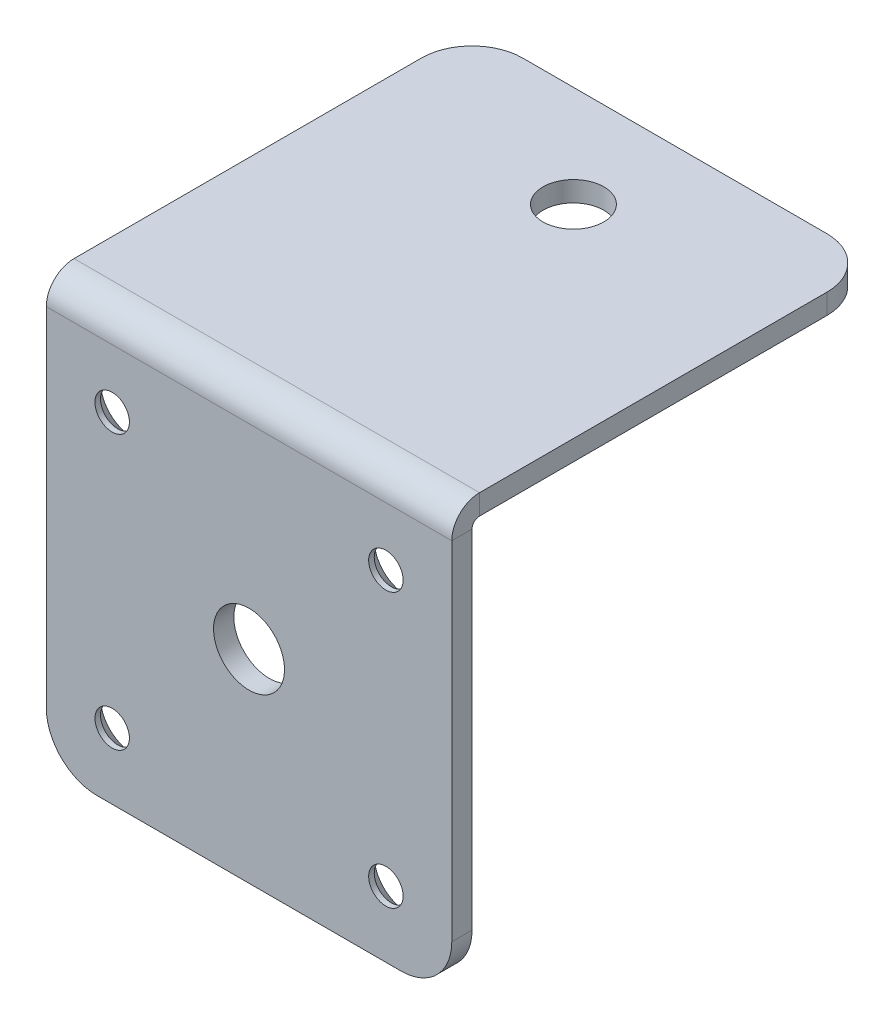
ISO-10303-21;
HEADER;
FILE_DESCRIPTION(('STEP AP214'),'2;1');
FILE_NAME('part.step','',(''),(''),'','','');
FILE_SCHEMA(('AUTOMOTIVE_DESIGN { 1 0 10303 214 1 1 1 1 }'));
ENDSEC;
DATA;
#1=APPLICATION_CONTEXT('core data for automotive mechanical design processes');
#2=APPLICATION_PROTOCOL_DEFINITION('international standard','automotive_design',2000,#1);
#3=PRODUCT_CONTEXT('',#1,'mechanical');
#4=PRODUCT('Part','Part','',(#3));
#5=PRODUCT_RELATED_PRODUCT_CATEGORY('part','',(#4));
#6=PRODUCT_DEFINITION_FORMATION('','',#4);
#7=PRODUCT_DEFINITION_CONTEXT('part definition',#1,'design');
#8=PRODUCT_DEFINITION('design','',#6,#7);
#9=PRODUCT_DEFINITION_SHAPE('','',#8);
#10=(LENGTH_UNIT() NAMED_UNIT(*) SI_UNIT(.MILLI.,.METRE.));
#11=(NAMED_UNIT(*) PLANE_ANGLE_UNIT() SI_UNIT($,.RADIAN.));
#12=(NAMED_UNIT(*) SI_UNIT($,.STERADIAN.) SOLID_ANGLE_UNIT());
#13=UNCERTAINTY_MEASURE_WITH_UNIT(LENGTH_MEASURE(1.E-05),#10,'distance_accuracy_value','');
#14=(GEOMETRIC_REPRESENTATION_CONTEXT(3) GLOBAL_UNCERTAINTY_ASSIGNED_CONTEXT((#13)) GLOBAL_UNIT_ASSIGNED_CONTEXT((#10,
#11,#12)) REPRESENTATION_CONTEXT('',''));
#15=CARTESIAN_POINT('',(0.,0.,0.));
#16=DIRECTION('',(0.,0.,1.));
#17=DIRECTION('',(1.,0.,0.));
#18=AXIS2_PLACEMENT_3D('',#15,#16,#17);
#19=CARTESIAN_POINT('',(0.,-2.,40.));
#20=DIRECTION('',(0.,1.,0.));
#21=DIRECTION('',(0.,0.,1.));
#22=AXIS2_PLACEMENT_3D('',#19,#20,#21);
#23=PLANE('',#22);
#24=CARTESIAN_POINT('',(20.,-2.,10.));
#25=DIRECTION('',(0.,1.,0.));
#26=DIRECTION('',(0.,0.,1.));
#27=AXIS2_PLACEMENT_3D('',#24,#25,#26);
#28=CIRCLE('',#27,3.);
#29=CARTESIAN_POINT('',(20.,-2.,13.));
#30=VERTEX_POINT('',#29);
#31=EDGE_CURVE('E190',#30,#30,#28,.F.);
#32=ORIENTED_EDGE('',*,*,#31,.F.);
#33=EDGE_LOOP('',(#32));
#34=FACE_BOUND('',#33,.T.);
#35=DIRECTION('',(0.,0.,-1.));
#36=VECTOR('',#35,1.);
#37=CARTESIAN_POINT('',(0.,-2.,40.));
#38=LINE('',#37,#36);
#39=CARTESIAN_POINT('',(0.,-2.,39.2634));
#40=VERTEX_POINT('',#39);
#41=CARTESIAN_POINT('',(0.,-2.,5.));
#42=VERTEX_POINT('',#41);
#43=EDGE_CURVE('E198',#40,#42,#38,.T.);
#44=ORIENTED_EDGE('',*,*,#43,.T.);
#45=CARTESIAN_POINT('',(5.,-2.,5.));
#46=DIRECTION('',(0.,1.,0.));
#47=DIRECTION('',(0.,0.,1.));
#48=AXIS2_PLACEMENT_3D('',#45,#46,#47);
#49=CIRCLE('',#48,5.);
#50=CARTESIAN_POINT('',(5.,-2.,0.));
#51=VERTEX_POINT('',#50);
#52=EDGE_CURVE('E42',#42,#51,#49,.F.);
#53=ORIENTED_EDGE('',*,*,#52,.T.);
#54=DIRECTION('',(1.,0.,0.));
#55=VECTOR('',#54,1.);
#56=CARTESIAN_POINT('',(0.,-2.,0.));
#57=LINE('',#56,#55);
#58=CARTESIAN_POINT('',(35.,-2.,0.));
#59=VERTEX_POINT('',#58);
#60=EDGE_CURVE('E193',#51,#59,#57,.T.);
#61=ORIENTED_EDGE('',*,*,#60,.T.);
#62=CARTESIAN_POINT('',(35.,-2.,5.));
#63=DIRECTION('',(0.,1.,0.));
#64=DIRECTION('',(0.,0.,1.));
#65=AXIS2_PLACEMENT_3D('',#62,#63,#64);
#66=CIRCLE('',#65,5.);
#67=CARTESIAN_POINT('',(40.,-2.,5.));
#68=VERTEX_POINT('',#67);
#69=EDGE_CURVE('E49',#59,#68,#66,.F.);
#70=ORIENTED_EDGE('',*,*,#69,.T.);
#71=DIRECTION('',(0.,0.,-1.));
#72=VECTOR('',#71,1.);
#73=CARTESIAN_POINT('',(40.,-2.,40.));
#74=LINE('',#73,#72);
#75=CARTESIAN_POINT('',(40.,-2.,39.2634));
#76=VERTEX_POINT('',#75);
#77=EDGE_CURVE('E205',#76,#68,#74,.T.);
#78=ORIENTED_EDGE('',*,*,#77,.F.);
#79=DIRECTION('',(-1.,0.,0.));
#80=VECTOR('',#79,1.);
#81=CARTESIAN_POINT('',(0.,-2.,39.2634));
#82=LINE('',#81,#80);
#83=EDGE_CURVE('E180',#40,#76,#82,.F.);
#84=ORIENTED_EDGE('',*,*,#83,.F.);
#85=EDGE_LOOP('',(#44,#53,#61,#70,#78,#84));
#86=FACE_BOUND('',#85,.T.);
#87=ADVANCED_FACE('F34',(#34,#86),#23,.F.);
#88=CARTESIAN_POINT('',(0.,0.,40.));
#89=DIRECTION('',(0.,1.,0.));
#90=DIRECTION('',(0.,0.,1.));
#91=AXIS2_PLACEMENT_3D('',#88,#89,#90);
#92=PLANE('',#91);
#93=CARTESIAN_POINT('',(20.,0.,10.));
#94=DIRECTION('',(0.,1.,0.));
#95=DIRECTION('',(0.,0.,1.));
#96=AXIS2_PLACEMENT_3D('',#93,#94,#95);
#97=CIRCLE('',#96,3.);
#98=CARTESIAN_POINT('',(20.,0.,13.));
#99=VERTEX_POINT('',#98);
#100=EDGE_CURVE('E186',#99,#99,#97,.T.);
#101=ORIENTED_EDGE('',*,*,#100,.F.);
#102=EDGE_LOOP('',(#101));
#103=FACE_BOUND('',#102,.T.);
#104=DIRECTION('',(1.,0.,0.));
#105=VECTOR('',#104,1.);
#106=CARTESIAN_POINT('',(0.,0.,0.));
#107=LINE('',#106,#105);
#108=CARTESIAN_POINT('',(5.,0.,0.));
#109=VERTEX_POINT('',#108);
#110=CARTESIAN_POINT('',(35.,0.,0.));
#111=VERTEX_POINT('',#110);
#112=EDGE_CURVE('E195',#109,#111,#107,.T.);
#113=ORIENTED_EDGE('',*,*,#112,.F.);
#114=CARTESIAN_POINT('',(5.,0.,5.));
#115=DIRECTION('',(0.,1.,0.));
#116=DIRECTION('',(0.,0.,1.));
#117=AXIS2_PLACEMENT_3D('',#114,#115,#116);
#118=CIRCLE('',#117,5.);
#119=CARTESIAN_POINT('',(0.,0.,5.));
#120=VERTEX_POINT('',#119);
#121=EDGE_CURVE('E232',#109,#120,#118,.T.);
#122=ORIENTED_EDGE('',*,*,#121,.T.);
#123=DIRECTION('',(0.,0.,-1.));
#124=VECTOR('',#123,1.);
#125=CARTESIAN_POINT('',(0.,0.,40.));
#126=LINE('',#125,#124);
#127=CARTESIAN_POINT('',(0.,0.,39.2634));
#128=VERTEX_POINT('',#127);
#129=EDGE_CURVE('E200',#128,#120,#126,.T.);
#130=ORIENTED_EDGE('',*,*,#129,.F.);
#131=DIRECTION('',(-1.,0.,0.));
#132=VECTOR('',#131,1.);
#133=CARTESIAN_POINT('',(0.,0.,39.2634));
#134=LINE('',#133,#132);
#135=CARTESIAN_POINT('',(40.,0.,39.2634));
#136=VERTEX_POINT('',#135);
#137=EDGE_CURVE('E132',#128,#136,#134,.F.);
#138=ORIENTED_EDGE('',*,*,#137,.T.);
#139=DIRECTION('',(0.,0.,-1.));
#140=VECTOR('',#139,1.);
#141=CARTESIAN_POINT('',(40.,0.,40.));
#142=LINE('',#141,#140);
#143=CARTESIAN_POINT('',(40.,0.,5.));
#144=VERTEX_POINT('',#143);
#145=EDGE_CURVE('E202',#136,#144,#142,.T.);
#146=ORIENTED_EDGE('',*,*,#145,.T.);
#147=CARTESIAN_POINT('',(35.,0.,5.));
#148=DIRECTION('',(0.,1.,0.));
#149=DIRECTION('',(0.,0.,1.));
#150=AXIS2_PLACEMENT_3D('',#147,#148,#149);
#151=CIRCLE('',#150,5.);
#152=EDGE_CURVE('E230',#144,#111,#151,.T.);
#153=ORIENTED_EDGE('',*,*,#152,.T.);
#154=EDGE_LOOP('',(#113,#122,#130,#138,#146,#153));
#155=FACE_BOUND('',#154,.T.);
#156=ADVANCED_FACE('F247',(#103,#155),#92,.T.);
#157=CARTESIAN_POINT('',(0.,-2.,40.));
#158=DIRECTION('',(-1.,0.,0.));
#159=DIRECTION('',(0.,0.,1.));
#160=AXIS2_PLACEMENT_3D('',#157,#158,#159);
#161=PLANE('',#160);
#162=ORIENTED_EDGE('',*,*,#129,.T.);
#163=DIRECTION('',(0.,1.,0.));
#164=VECTOR('',#163,1.);
#165=CARTESIAN_POINT('',(0.,-2.,5.));
#166=LINE('',#165,#164);
#167=EDGE_CURVE('E57',#120,#42,#166,.F.);
#168=ORIENTED_EDGE('',*,*,#167,.T.);
#169=ORIENTED_EDGE('',*,*,#43,.F.);
#170=DIRECTION('',(0.,1.,0.));
#171=VECTOR('',#170,1.);
#172=CARTESIAN_POINT('',(0.,-2.,39.2634));
#173=LINE('',#172,#171);
#174=EDGE_CURVE('E176',#40,#128,#173,.T.);
#175=ORIENTED_EDGE('',*,*,#174,.T.);
#176=EDGE_LOOP('',(#162,#168,#169,#175));
#177=FACE_BOUND('',#176,.T.);
#178=ADVANCED_FACE('F248',(#177),#161,.T.);
#179=CARTESIAN_POINT('',(40.,0.,40.));
#180=DIRECTION('',(1.,0.,0.));
#181=DIRECTION('',(0.,0.,-1.));
#182=AXIS2_PLACEMENT_3D('',#179,#180,#181);
#183=PLANE('',#182);
#184=ORIENTED_EDGE('',*,*,#77,.T.);
#185=DIRECTION('',(0.,-1.,0.));
#186=VECTOR('',#185,1.);
#187=CARTESIAN_POINT('',(40.,0.,5.));
#188=LINE('',#187,#186);
#189=EDGE_CURVE('E11',#68,#144,#188,.F.);
#190=ORIENTED_EDGE('',*,*,#189,.T.);
#191=ORIENTED_EDGE('',*,*,#145,.F.);
#192=DIRECTION('',(0.,1.,0.));
#193=VECTOR('',#192,1.);
#194=CARTESIAN_POINT('',(40.,-2.,39.2634));
#195=LINE('',#194,#193);
#196=EDGE_CURVE('E183',#76,#136,#195,.T.);
#197=ORIENTED_EDGE('',*,*,#196,.F.);
#198=EDGE_LOOP('',(#184,#190,#191,#197));
#199=FACE_BOUND('',#198,.T.);
#200=ADVANCED_FACE('F256',(#199),#183,.T.);
#201=CARTESIAN_POINT('',(40.,-2.,0.));
#202=DIRECTION('',(0.,0.,-1.));
#203=DIRECTION('',(-1.,0.,0.));
#204=AXIS2_PLACEMENT_3D('',#201,#202,#203);
#205=PLANE('',#204);
#206=ORIENTED_EDGE('',*,*,#60,.F.);
#207=DIRECTION('',(0.,1.,0.));
#208=VECTOR('',#207,1.);
#209=CARTESIAN_POINT('',(5.,-2.,0.));
#210=LINE('',#209,#208);
#211=EDGE_CURVE('E227',#51,#109,#210,.T.);
#212=ORIENTED_EDGE('',*,*,#211,.T.);
#213=ORIENTED_EDGE('',*,*,#112,.T.);
#214=DIRECTION('',(0.,-1.,0.));
#215=VECTOR('',#214,1.);
#216=CARTESIAN_POINT('',(35.,-2.,0.));
#217=LINE('',#216,#215);
#218=EDGE_CURVE('E224',#111,#59,#217,.T.);
#219=ORIENTED_EDGE('',*,*,#218,.T.);
#220=EDGE_LOOP('',(#206,#212,#213,#219));
#221=FACE_BOUND('',#220,.T.);
#222=ADVANCED_FACE('F241',(#221),#205,.T.);
#223=CARTESIAN_POINT('',(20.,-2.001,10.));
#224=DIRECTION('',(0.,1.,0.));
#225=DIRECTION('',(0.,0.,1.));
#226=AXIS2_PLACEMENT_3D('',#223,#224,#225);
#227=CYLINDRICAL_SURFACE('',#226,3.);
#228=ORIENTED_EDGE('',*,*,#100,.T.);
#229=EDGE_LOOP('',(#228));
#230=FACE_BOUND('',#229,.T.);
#231=ORIENTED_EDGE('',*,*,#31,.T.);
#232=EDGE_LOOP('',(#231));
#233=FACE_BOUND('',#232,.T.);
#234=ADVANCED_FACE('F393',(#230,#233),#227,.F.);
#235=CARTESIAN_POINT('',(40.,-2.7366,39.2634));
#236=DIRECTION('',(1.,0.,0.));
#237=DIRECTION('',(0.,0.,-1.));
#238=AXIS2_PLACEMENT_3D('',#235,#236,#237);
#239=PLANE('',#238);
#240=DIRECTION('',(0.,0.,1.));
#241=VECTOR('',#240,1.);
#242=CARTESIAN_POINT('',(40.,-2.7366,40.));
#243=LINE('',#242,#241);
#244=CARTESIAN_POINT('',(40.,-2.7366,40.));
#245=VERTEX_POINT('',#244);
#246=CARTESIAN_POINT('',(40.,-2.73659999999999,42.));
#247=VERTEX_POINT('',#246);
#248=EDGE_CURVE('E302',#245,#247,#243,.T.);
#249=ORIENTED_EDGE('',*,*,#248,.F.);
#250=CARTESIAN_POINT('',(40.,-2.7366,39.2634));
#251=DIRECTION('',(-1.,0.,0.));
#252=DIRECTION('',(0.,0.,1.));
#253=AXIS2_PLACEMENT_3D('',#250,#251,#252);
#254=CIRCLE('',#253,0.736599999999997);
#255=EDGE_CURVE('E135',#76,#245,#254,.F.);
#256=ORIENTED_EDGE('',*,*,#255,.F.);
#257=ORIENTED_EDGE('',*,*,#196,.T.);
#258=CARTESIAN_POINT('',(40.,-2.7366,39.2634));
#259=DIRECTION('',(-1.,0.,0.));
#260=DIRECTION('',(0.,0.,1.));
#261=AXIS2_PLACEMENT_3D('',#258,#259,#260);
#262=CIRCLE('',#261,2.7366);
#263=EDGE_CURVE('E175',#136,#247,#262,.F.);
#264=ORIENTED_EDGE('',*,*,#263,.T.);
#265=EDGE_LOOP('',(#249,#256,#257,#264));
#266=FACE_BOUND('',#265,.T.);
#267=ADVANCED_FACE('F390',(#266),#239,.T.);
#268=CARTESIAN_POINT('',(0.,-2.7366,39.2634));
#269=DIRECTION('',(1.,0.,0.));
#270=DIRECTION('',(0.,0.,-1.));
#271=AXIS2_PLACEMENT_3D('',#268,#269,#270);
#272=PLANE('',#271);
#273=CARTESIAN_POINT('',(0.,-2.7366,39.2634));
#274=DIRECTION('',(-1.,0.,0.));
#275=DIRECTION('',(0.,0.,1.));
#276=AXIS2_PLACEMENT_3D('',#273,#274,#275);
#277=CIRCLE('',#276,0.736599999999997);
#278=CARTESIAN_POINT('',(0.,-2.7366,40.));
#279=VERTEX_POINT('',#278);
#280=EDGE_CURVE('E142',#279,#40,#277,.T.);
#281=ORIENTED_EDGE('',*,*,#280,.F.);
#282=DIRECTION('',(0.,0.,1.));
#283=VECTOR('',#282,1.);
#284=CARTESIAN_POINT('',(0.,-2.7366,40.));
#285=LINE('',#284,#283);
#286=CARTESIAN_POINT('',(0.,-2.7366,42.));
#287=VERTEX_POINT('',#286);
#288=EDGE_CURVE('E139',#279,#287,#285,.T.);
#289=ORIENTED_EDGE('',*,*,#288,.T.);
#290=CARTESIAN_POINT('',(0.,-2.7366,39.2634));
#291=DIRECTION('',(-1.,0.,0.));
#292=DIRECTION('',(0.,0.,1.));
#293=AXIS2_PLACEMENT_3D('',#290,#291,#292);
#294=CIRCLE('',#293,2.7366);
#295=EDGE_CURVE('E125',#287,#128,#294,.T.);
#296=ORIENTED_EDGE('',*,*,#295,.T.);
#297=ORIENTED_EDGE('',*,*,#174,.F.);
#298=EDGE_LOOP('',(#281,#289,#296,#297));
#299=FACE_BOUND('',#298,.T.);
#300=ADVANCED_FACE('F140',(#299),#272,.F.);
#301=CARTESIAN_POINT('',(0.,-2.7366,39.2634));
#302=DIRECTION('',(-1.,0.,0.));
#303=DIRECTION('',(0.,0.,1.));
#304=AXIS2_PLACEMENT_3D('',#301,#302,#303);
#305=CYLINDRICAL_SURFACE('',#304,2.7366);
#306=ORIENTED_EDGE('',*,*,#137,.F.);
#307=ORIENTED_EDGE('',*,*,#295,.F.);
#308=DIRECTION('',(1.,0.,0.));
#309=VECTOR('',#308,1.);
#310=CARTESIAN_POINT('',(0.,-2.7366,42.));
#311=LINE('',#310,#309);
#312=EDGE_CURVE('E129',#287,#247,#311,.T.);
#313=ORIENTED_EDGE('',*,*,#312,.T.);
#314=ORIENTED_EDGE('',*,*,#263,.F.);
#315=EDGE_LOOP('',(#306,#307,#313,#314));
#316=FACE_BOUND('',#315,.T.);
#317=ADVANCED_FACE('F127',(#316),#305,.T.);
#318=CARTESIAN_POINT('',(0.,-2.7366,39.2634));
#319=DIRECTION('',(-1.,0.,0.));
#320=DIRECTION('',(0.,0.,1.));
#321=AXIS2_PLACEMENT_3D('',#318,#319,#320);
#322=CYLINDRICAL_SURFACE('',#321,0.736599999999997);
#323=ORIENTED_EDGE('',*,*,#83,.T.);
#324=ORIENTED_EDGE('',*,*,#255,.T.);
#325=DIRECTION('',(-1.,0.,0.));
#326=VECTOR('',#325,1.);
#327=CARTESIAN_POINT('',(40.,-2.7366,40.));
#328=LINE('',#327,#326);
#329=EDGE_CURVE('E147',#245,#279,#328,.T.);
#330=ORIENTED_EDGE('',*,*,#329,.T.);
#331=ORIENTED_EDGE('',*,*,#280,.T.);
#332=EDGE_LOOP('',(#323,#324,#330,#331));
#333=FACE_BOUND('',#332,.T.);
#334=ADVANCED_FACE('F250',(#333),#322,.F.);
#335=CARTESIAN_POINT('',(0.,-42.,42.0000000000001));
#336=DIRECTION('',(1.,0.,0.));
#337=DIRECTION('',(0.,0.,-1.));
#338=AXIS2_PLACEMENT_3D('',#335,#336,#337);
#339=PLANE('',#338);
#340=DIRECTION('',(0.,-1.,0.));
#341=VECTOR('',#340,1.);
#342=CARTESIAN_POINT('',(0.,-42.,40.0000000000001));
#343=LINE('',#342,#341);
#344=CARTESIAN_POINT('',(0.,-37.,40.0000000000001));
#345=VERTEX_POINT('',#344);
#346=EDGE_CURVE('E157',#279,#345,#343,.T.);
#347=ORIENTED_EDGE('',*,*,#346,.T.);
#348=DIRECTION('',(0.,0.,-1.));
#349=VECTOR('',#348,1.);
#350=CARTESIAN_POINT('',(0.,-37.,42.0000000000001));
#351=LINE('',#350,#349);
#352=CARTESIAN_POINT('',(0.,-37.,42.0000000000001));
#353=VERTEX_POINT('',#352);
#354=EDGE_CURVE('E161',#345,#353,#351,.F.);
#355=ORIENTED_EDGE('',*,*,#354,.T.);
#356=DIRECTION('',(0.,-1.,0.));
#357=VECTOR('',#356,1.);
#358=CARTESIAN_POINT('',(0.,-42.,42.0000000000001));
#359=LINE('',#358,#357);
#360=EDGE_CURVE('E153',#287,#353,#359,.T.);
#361=ORIENTED_EDGE('',*,*,#360,.F.);
#362=ORIENTED_EDGE('',*,*,#288,.F.);
#363=EDGE_LOOP('',(#347,#355,#361,#362));
#364=FACE_BOUND('',#363,.T.);
#365=ADVANCED_FACE('F159',(#364),#339,.F.);
#366=CARTESIAN_POINT('',(40.,-1.99999999999999,42.));
#367=DIRECTION('',(-1.,0.,0.));
#368=DIRECTION('',(0.,0.,1.));
#369=AXIS2_PLACEMENT_3D('',#366,#367,#368);
#370=PLANE('',#369);
#371=DIRECTION('',(0.,1.,0.));
#372=VECTOR('',#371,1.);
#373=CARTESIAN_POINT('',(40.,-1.99999999999999,42.));
#374=LINE('',#373,#372);
#375=CARTESIAN_POINT('',(40.,-37.,42.0000000000001));
#376=VERTEX_POINT('',#375);
#377=EDGE_CURVE('E156',#376,#247,#374,.T.);
#378=ORIENTED_EDGE('',*,*,#377,.F.);
#379=DIRECTION('',(0.,0.,-1.));
#380=VECTOR('',#379,1.);
#381=CARTESIAN_POINT('',(40.,-37.,42.0000000000001));
#382=LINE('',#381,#380);
#383=CARTESIAN_POINT('',(40.,-37.,40.0000000000001));
#384=VERTEX_POINT('',#383);
#385=EDGE_CURVE('E207',#376,#384,#382,.T.);
#386=ORIENTED_EDGE('',*,*,#385,.T.);
#387=DIRECTION('',(0.,1.,0.));
#388=VECTOR('',#387,1.);
#389=CARTESIAN_POINT('',(40.,-2.,40.));
#390=LINE('',#389,#388);
#391=EDGE_CURVE('E163',#384,#245,#390,.T.);
#392=ORIENTED_EDGE('',*,*,#391,.T.);
#393=ORIENTED_EDGE('',*,*,#248,.T.);
#394=EDGE_LOOP('',(#378,#386,#392,#393));
#395=FACE_BOUND('',#394,.T.);
#396=ADVANCED_FACE('F299',(#395),#370,.F.);
#397=CARTESIAN_POINT('',(0.,-1.99999999999999,42.));
#398=DIRECTION('',(0.,0.,-1.));
#399=DIRECTION('',(0.,1.,0.));
#400=AXIS2_PLACEMENT_3D('',#397,#398,#399);
#401=PLANE('',#400);
#402=CARTESIAN_POINT('',(20.,-22.,42.0000000000001));
#403=DIRECTION('',(0.,0.,-1.));
#404=DIRECTION('',(0.,1.,0.));
#405=AXIS2_PLACEMENT_3D('',#402,#403,#404);
#406=CIRCLE('',#405,3.5);
#407=CARTESIAN_POINT('',(20.,-18.5,42.0000000000001));
#408=VERTEX_POINT('',#407);
#409=EDGE_CURVE('E342',#408,#408,#406,.T.);
#410=ORIENTED_EDGE('',*,*,#409,.T.);
#411=EDGE_LOOP('',(#410));
#412=FACE_BOUND('',#411,.T.);
#413=CARTESIAN_POINT('',(33.5,-35.5,42.0000000000001));
#414=DIRECTION('',(0.,0.,-1.));
#415=DIRECTION('',(0.,1.,0.));
#416=AXIS2_PLACEMENT_3D('',#413,#414,#415);
#417=CIRCLE('',#416,1.69999999999999);
#418=CARTESIAN_POINT('',(33.5,-33.8,42.0000000000001));
#419=VERTEX_POINT('',#418);
#420=EDGE_CURVE('E333',#419,#419,#417,.T.);
#421=ORIENTED_EDGE('',*,*,#420,.T.);
#422=EDGE_LOOP('',(#421));
#423=FACE_BOUND('',#422,.T.);
#424=CARTESIAN_POINT('',(33.5,-8.49999999999999,42.));
#425=DIRECTION('',(0.,0.,-1.));
#426=DIRECTION('',(0.,1.,0.));
#427=AXIS2_PLACEMENT_3D('',#424,#425,#426);
#428=CIRCLE('',#427,1.69999999999999);
#429=CARTESIAN_POINT('',(33.5,-6.80000000000001,42.));
#430=VERTEX_POINT('',#429);
#431=EDGE_CURVE('E324',#430,#430,#428,.T.);
#432=ORIENTED_EDGE('',*,*,#431,.T.);
#433=EDGE_LOOP('',(#432));
#434=FACE_BOUND('',#433,.T.);
#435=CARTESIAN_POINT('',(6.5,-8.49999999999999,42.));
#436=DIRECTION('',(0.,0.,-1.));
#437=DIRECTION('',(0.,1.,0.));
#438=AXIS2_PLACEMENT_3D('',#435,#436,#437);
#439=CIRCLE('',#438,1.69999999999999);
#440=CARTESIAN_POINT('',(6.5,-6.80000000000001,42.));
#441=VERTEX_POINT('',#440);
#442=EDGE_CURVE('E315',#441,#441,#439,.T.);
#443=ORIENTED_EDGE('',*,*,#442,.T.);
#444=EDGE_LOOP('',(#443));
#445=FACE_BOUND('',#444,.T.);
#446=CARTESIAN_POINT('',(6.5,-35.5,42.0000000000001));
#447=DIRECTION('',(0.,0.,-1.));
#448=DIRECTION('',(0.,1.,0.));
#449=AXIS2_PLACEMENT_3D('',#446,#447,#448);
#450=CIRCLE('',#449,1.69999999999999);
#451=CARTESIAN_POINT('',(6.5,-33.8,42.0000000000001));
#452=VERTEX_POINT('',#451);
#453=EDGE_CURVE('E304',#452,#452,#450,.T.);
#454=ORIENTED_EDGE('',*,*,#453,.T.);
#455=EDGE_LOOP('',(#454));
#456=FACE_BOUND('',#455,.T.);
#457=DIRECTION('',(1.,0.,0.));
#458=VECTOR('',#457,1.);
#459=CARTESIAN_POINT('',(40.,-42.,42.0000000000001));
#460=LINE('',#459,#458);
#461=CARTESIAN_POINT('',(5.,-42.,42.0000000000001));
#462=VERTEX_POINT('',#461);
#463=CARTESIAN_POINT('',(35.,-42.,42.0000000000001));
#464=VERTEX_POINT('',#463);
#465=EDGE_CURVE('E162',#462,#464,#460,.T.);
#466=ORIENTED_EDGE('',*,*,#465,.T.);
#467=CARTESIAN_POINT('',(35.,-37.,42.0000000000001));
#468=DIRECTION('',(0.,0.,-1.));
#469=DIRECTION('',(0.,1.,0.));
#470=AXIS2_PLACEMENT_3D('',#467,#468,#469);
#471=CIRCLE('',#470,5.);
#472=EDGE_CURVE('E221',#464,#376,#471,.F.);
#473=ORIENTED_EDGE('',*,*,#472,.T.);
#474=ORIENTED_EDGE('',*,*,#377,.T.);
#475=ORIENTED_EDGE('',*,*,#312,.F.);
#476=ORIENTED_EDGE('',*,*,#360,.T.);
#477=CARTESIAN_POINT('',(5.,-37.,42.0000000000001));
#478=DIRECTION('',(0.,0.,-1.));
#479=DIRECTION('',(0.,1.,0.));
#480=AXIS2_PLACEMENT_3D('',#477,#478,#479);
#481=CIRCLE('',#480,5.);
#482=EDGE_CURVE('E219',#353,#462,#481,.F.);
#483=ORIENTED_EDGE('',*,*,#482,.T.);
#484=EDGE_LOOP('',(#466,#473,#474,#475,#476,#483));
#485=FACE_BOUND('',#484,.T.);
#486=ADVANCED_FACE('F152',(#412,#423,#434,#445,#456,#485),#401,.F.);
#487=CARTESIAN_POINT('',(0.,-2.,40.));
#488=DIRECTION('',(0.,0.,-1.));
#489=DIRECTION('',(0.,1.,0.));
#490=AXIS2_PLACEMENT_3D('',#487,#488,#489);
#491=PLANE('',#490);
#492=CARTESIAN_POINT('',(20.,-22.,40.0000000000001));
#493=DIRECTION('',(0.,0.,-1.));
#494=DIRECTION('',(0.,1.,0.));
#495=AXIS2_PLACEMENT_3D('',#492,#493,#494);
#496=CIRCLE('',#495,3.5);
#497=CARTESIAN_POINT('',(20.,-18.5,40.0000000000001));
#498=VERTEX_POINT('',#497);
#499=EDGE_CURVE('E345',#498,#498,#496,.T.);
#500=ORIENTED_EDGE('',*,*,#499,.F.);
#501=EDGE_LOOP('',(#500));
#502=FACE_BOUND('',#501,.T.);
#503=CARTESIAN_POINT('',(33.5,-35.5,40.0000000000001));
#504=DIRECTION('',(0.,0.,-1.));
#505=DIRECTION('',(0.,1.,0.));
#506=AXIS2_PLACEMENT_3D('',#503,#504,#505);
#507=CIRCLE('',#506,3.15);
#508=CARTESIAN_POINT('',(33.5,-32.35,40.0000000000001));
#509=VERTEX_POINT('',#508);
#510=EDGE_CURVE('E339',#509,#509,#507,.T.);
#511=ORIENTED_EDGE('',*,*,#510,.F.);
#512=EDGE_LOOP('',(#511));
#513=FACE_BOUND('',#512,.T.);
#514=CARTESIAN_POINT('',(33.5,-8.5,40.));
#515=DIRECTION('',(0.,0.,-1.));
#516=DIRECTION('',(0.,1.,0.));
#517=AXIS2_PLACEMENT_3D('',#514,#515,#516);
#518=CIRCLE('',#517,3.15);
#519=CARTESIAN_POINT('',(33.5,-5.35,40.));
#520=VERTEX_POINT('',#519);
#521=EDGE_CURVE('E330',#520,#520,#518,.T.);
#522=ORIENTED_EDGE('',*,*,#521,.F.);
#523=EDGE_LOOP('',(#522));
#524=FACE_BOUND('',#523,.T.);
#525=CARTESIAN_POINT('',(6.5,-8.5,40.));
#526=DIRECTION('',(0.,0.,-1.));
#527=DIRECTION('',(0.,1.,0.));
#528=AXIS2_PLACEMENT_3D('',#525,#526,#527);
#529=CIRCLE('',#528,3.15);
#530=CARTESIAN_POINT('',(6.5,-5.35,40.));
#531=VERTEX_POINT('',#530);
#532=EDGE_CURVE('E321',#531,#531,#529,.T.);
#533=ORIENTED_EDGE('',*,*,#532,.F.);
#534=EDGE_LOOP('',(#533));
#535=FACE_BOUND('',#534,.T.);
#536=CARTESIAN_POINT('',(6.5,-35.5,40.0000000000001));
#537=DIRECTION('',(0.,0.,-1.));
#538=DIRECTION('',(0.,1.,0.));
#539=AXIS2_PLACEMENT_3D('',#536,#537,#538);
#540=CIRCLE('',#539,3.15);
#541=CARTESIAN_POINT('',(6.5,-32.35,40.0000000000001));
#542=VERTEX_POINT('',#541);
#543=EDGE_CURVE('E312',#542,#542,#540,.T.);
#544=ORIENTED_EDGE('',*,*,#543,.F.);
#545=EDGE_LOOP('',(#544));
#546=FACE_BOUND('',#545,.T.);
#547=ORIENTED_EDGE('',*,*,#391,.F.);
#548=CARTESIAN_POINT('',(35.,-37.,40.0000000000001));
#549=DIRECTION('',(0.,0.,-1.));
#550=DIRECTION('',(0.,1.,0.));
#551=AXIS2_PLACEMENT_3D('',#548,#549,#550);
#552=CIRCLE('',#551,5.);
#553=CARTESIAN_POINT('',(35.,-42.,40.0000000000001));
#554=VERTEX_POINT('',#553);
#555=EDGE_CURVE('E212',#384,#554,#552,.T.);
#556=ORIENTED_EDGE('',*,*,#555,.T.);
#557=DIRECTION('',(1.,0.,0.));
#558=VECTOR('',#557,1.);
#559=CARTESIAN_POINT('',(40.,-42.,40.0000000000001));
#560=LINE('',#559,#558);
#561=CARTESIAN_POINT('',(5.,-42.,40.0000000000001));
#562=VERTEX_POINT('',#561);
#563=EDGE_CURVE('E166',#562,#554,#560,.T.);
#564=ORIENTED_EDGE('',*,*,#563,.F.);
#565=CARTESIAN_POINT('',(5.,-37.,40.0000000000001));
#566=DIRECTION('',(0.,0.,-1.));
#567=DIRECTION('',(0.,1.,0.));
#568=AXIS2_PLACEMENT_3D('',#565,#566,#567);
#569=CIRCLE('',#568,5.);
#570=EDGE_CURVE('E210',#562,#345,#569,.T.);
#571=ORIENTED_EDGE('',*,*,#570,.T.);
#572=ORIENTED_EDGE('',*,*,#346,.F.);
#573=ORIENTED_EDGE('',*,*,#329,.F.);
#574=EDGE_LOOP('',(#547,#556,#564,#571,#572,#573));
#575=FACE_BOUND('',#574,.T.);
#576=ADVANCED_FACE('F351',(#502,#513,#524,#535,#546,#575),#491,.T.);
#577=CARTESIAN_POINT('',(40.,-42.,42.0000000000001));
#578=DIRECTION('',(0.,1.,0.));
#579=DIRECTION('',(0.,0.,1.));
#580=AXIS2_PLACEMENT_3D('',#577,#578,#579);
#581=PLANE('',#580);
#582=ORIENTED_EDGE('',*,*,#563,.T.);
#583=DIRECTION('',(0.,0.,-1.));
#584=VECTOR('',#583,1.);
#585=CARTESIAN_POINT('',(35.,-42.,42.0000000000001));
#586=LINE('',#585,#584);
#587=EDGE_CURVE('E217',#554,#464,#586,.F.);
#588=ORIENTED_EDGE('',*,*,#587,.T.);
#589=ORIENTED_EDGE('',*,*,#465,.F.);
#590=DIRECTION('',(0.,0.,-1.));
#591=VECTOR('',#590,1.);
#592=CARTESIAN_POINT('',(5.,-42.,42.0000000000001));
#593=LINE('',#592,#591);
#594=EDGE_CURVE('E214',#462,#562,#593,.T.);
#595=ORIENTED_EDGE('',*,*,#594,.T.);
#596=EDGE_LOOP('',(#582,#588,#589,#595));
#597=FACE_BOUND('',#596,.T.);
#598=ADVANCED_FACE('F284',(#597),#581,.F.);
#599=CARTESIAN_POINT('',(35.,-37.,42.0000000000001));
#600=DIRECTION('',(0.,0.,-1.));
#601=DIRECTION('',(0.,1.,0.));
#602=AXIS2_PLACEMENT_3D('',#599,#600,#601);
#603=CYLINDRICAL_SURFACE('',#602,5.);
#604=ORIENTED_EDGE('',*,*,#472,.F.);
#605=ORIENTED_EDGE('',*,*,#587,.F.);
#606=ORIENTED_EDGE('',*,*,#555,.F.);
#607=ORIENTED_EDGE('',*,*,#385,.F.);
#608=EDGE_LOOP('',(#604,#605,#606,#607));
#609=FACE_BOUND('',#608,.T.);
#610=ADVANCED_FACE('F281',(#609),#603,.T.);
#611=CARTESIAN_POINT('',(5.,-37.,42.0000000000001));
#612=DIRECTION('',(0.,0.,-1.));
#613=DIRECTION('',(0.,1.,0.));
#614=AXIS2_PLACEMENT_3D('',#611,#612,#613);
#615=CYLINDRICAL_SURFACE('',#614,5.);
#616=ORIENTED_EDGE('',*,*,#482,.F.);
#617=ORIENTED_EDGE('',*,*,#354,.F.);
#618=ORIENTED_EDGE('',*,*,#570,.F.);
#619=ORIENTED_EDGE('',*,*,#594,.F.);
#620=EDGE_LOOP('',(#616,#617,#618,#619));
#621=FACE_BOUND('',#620,.T.);
#622=ADVANCED_FACE('F269',(#621),#615,.T.);
#623=CARTESIAN_POINT('',(5.,-2.,5.));
#624=DIRECTION('',(0.,1.,0.));
#625=DIRECTION('',(0.,0.,1.));
#626=AXIS2_PLACEMENT_3D('',#623,#624,#625);
#627=CYLINDRICAL_SURFACE('',#626,5.);
#628=ORIENTED_EDGE('',*,*,#52,.F.);
#629=ORIENTED_EDGE('',*,*,#167,.F.);
#630=ORIENTED_EDGE('',*,*,#121,.F.);
#631=ORIENTED_EDGE('',*,*,#211,.F.);
#632=EDGE_LOOP('',(#628,#629,#630,#631));
#633=FACE_BOUND('',#632,.T.);
#634=ADVANCED_FACE('F244',(#633),#627,.T.);
#635=CARTESIAN_POINT('',(35.,-2.,5.));
#636=DIRECTION('',(0.,-1.,0.));
#637=DIRECTION('',(0.,0.,-1.));
#638=AXIS2_PLACEMENT_3D('',#635,#636,#637);
#639=CYLINDRICAL_SURFACE('',#638,5.);
#640=ORIENTED_EDGE('',*,*,#152,.F.);
#641=ORIENTED_EDGE('',*,*,#189,.F.);
#642=ORIENTED_EDGE('',*,*,#69,.F.);
#643=ORIENTED_EDGE('',*,*,#218,.F.);
#644=EDGE_LOOP('',(#640,#641,#642,#643));
#645=FACE_BOUND('',#644,.T.);
#646=ADVANCED_FACE('F36',(#645),#639,.T.);
#647=CARTESIAN_POINT('',(6.5,-35.5,40.0000000000001));
#648=DIRECTION('',(0.,0.,-1.));
#649=DIRECTION('',(0.,1.,0.));
#650=AXIS2_PLACEMENT_3D('',#647,#648,#649);
#651=CYLINDRICAL_SURFACE('',#650,1.69999999999999);
#652=ORIENTED_EDGE('',*,*,#453,.F.);
#653=EDGE_LOOP('',(#652));
#654=FACE_BOUND('',#653,.T.);
#655=CARTESIAN_POINT('',(6.5,-35.5,41.4500000000001));
#656=DIRECTION('',(0.,0.,-1.));
#657=DIRECTION('',(0.,1.,0.));
#658=AXIS2_PLACEMENT_3D('',#655,#656,#657);
#659=CIRCLE('',#658,1.7);
#660=CARTESIAN_POINT('',(6.5,-33.8,41.4500000000001));
#661=VERTEX_POINT('',#660);
#662=EDGE_CURVE('E307',#661,#661,#659,.T.);
#663=ORIENTED_EDGE('',*,*,#662,.T.);
#664=EDGE_LOOP('',(#663));
#665=FACE_BOUND('',#664,.T.);
#666=ADVANCED_FACE('F261',(#654,#665),#651,.F.);
#667=CARTESIAN_POINT('',(6.5,-35.5,40.0000000000001));
#668=DIRECTION('',(0.,0.,-1.));
#669=DIRECTION('',(0.,1.,0.));
#670=AXIS2_PLACEMENT_3D('',#667,#668,#669);
#671=CONICAL_SURFACE('',#670,3.15,0.785398163397448);
#672=ORIENTED_EDGE('',*,*,#662,.F.);
#673=EDGE_LOOP('',(#672));
#674=FACE_BOUND('',#673,.T.);
#675=ORIENTED_EDGE('',*,*,#543,.T.);
#676=EDGE_LOOP('',(#675));
#677=FACE_BOUND('',#676,.T.);
#678=ADVANCED_FACE('F266',(#674,#677),#671,.F.);
#679=CARTESIAN_POINT('',(6.5,-8.5,40.));
#680=DIRECTION('',(0.,0.,-1.));
#681=DIRECTION('',(0.,1.,0.));
#682=AXIS2_PLACEMENT_3D('',#679,#680,#681);
#683=CYLINDRICAL_SURFACE('',#682,1.69999999999999);
#684=ORIENTED_EDGE('',*,*,#442,.F.);
#685=EDGE_LOOP('',(#684));
#686=FACE_BOUND('',#685,.T.);
#687=CARTESIAN_POINT('',(6.5,-8.5,41.45));
#688=DIRECTION('',(0.,0.,-1.));
#689=DIRECTION('',(0.,1.,0.));
#690=AXIS2_PLACEMENT_3D('',#687,#688,#689);
#691=CIRCLE('',#690,1.7);
#692=CARTESIAN_POINT('',(6.5,-6.8,41.45));
#693=VERTEX_POINT('',#692);
#694=EDGE_CURVE('E318',#693,#693,#691,.T.);
#695=ORIENTED_EDGE('',*,*,#694,.T.);
#696=EDGE_LOOP('',(#695));
#697=FACE_BOUND('',#696,.T.);
#698=ADVANCED_FACE('F365',(#686,#697),#683,.F.);
#699=CARTESIAN_POINT('',(6.5,-8.5,40.));
#700=DIRECTION('',(0.,0.,-1.));
#701=DIRECTION('',(0.,1.,0.));
#702=AXIS2_PLACEMENT_3D('',#699,#700,#701);
#703=CONICAL_SURFACE('',#702,3.15,0.785398163397448);
#704=ORIENTED_EDGE('',*,*,#694,.F.);
#705=EDGE_LOOP('',(#704));
#706=FACE_BOUND('',#705,.T.);
#707=ORIENTED_EDGE('',*,*,#532,.T.);
#708=EDGE_LOOP('',(#707));
#709=FACE_BOUND('',#708,.T.);
#710=ADVANCED_FACE('F371',(#706,#709),#703,.F.);
#711=CARTESIAN_POINT('',(33.5,-8.5,40.));
#712=DIRECTION('',(0.,0.,-1.));
#713=DIRECTION('',(0.,1.,0.));
#714=AXIS2_PLACEMENT_3D('',#711,#712,#713);
#715=CYLINDRICAL_SURFACE('',#714,1.69999999999999);
#716=ORIENTED_EDGE('',*,*,#431,.F.);
#717=EDGE_LOOP('',(#716));
#718=FACE_BOUND('',#717,.T.);
#719=CARTESIAN_POINT('',(33.5,-8.5,41.45));
#720=DIRECTION('',(0.,0.,-1.));
#721=DIRECTION('',(0.,1.,0.));
#722=AXIS2_PLACEMENT_3D('',#719,#720,#721);
#723=CIRCLE('',#722,1.7);
#724=CARTESIAN_POINT('',(33.5,-6.8,41.45));
#725=VERTEX_POINT('',#724);
#726=EDGE_CURVE('E327',#725,#725,#723,.T.);
#727=ORIENTED_EDGE('',*,*,#726,.T.);
#728=EDGE_LOOP('',(#727));
#729=FACE_BOUND('',#728,.T.);
#730=ADVANCED_FACE('F502',(#718,#729),#715,.F.);
#731=CARTESIAN_POINT('',(33.5,-8.5,40.));
#732=DIRECTION('',(0.,0.,-1.));
#733=DIRECTION('',(0.,1.,0.));
#734=AXIS2_PLACEMENT_3D('',#731,#732,#733);
#735=CONICAL_SURFACE('',#734,3.15,0.785398163397448);
#736=ORIENTED_EDGE('',*,*,#726,.F.);
#737=EDGE_LOOP('',(#736));
#738=FACE_BOUND('',#737,.T.);
#739=ORIENTED_EDGE('',*,*,#521,.T.);
#740=EDGE_LOOP('',(#739));
#741=FACE_BOUND('',#740,.T.);
#742=ADVANCED_FACE('F511',(#738,#741),#735,.F.);
#743=CARTESIAN_POINT('',(33.5,-35.5,40.0000000000001));
#744=DIRECTION('',(0.,0.,-1.));
#745=DIRECTION('',(0.,1.,0.));
#746=AXIS2_PLACEMENT_3D('',#743,#744,#745);
#747=CYLINDRICAL_SURFACE('',#746,1.69999999999999);
#748=ORIENTED_EDGE('',*,*,#420,.F.);
#749=EDGE_LOOP('',(#748));
#750=FACE_BOUND('',#749,.T.);
#751=CARTESIAN_POINT('',(33.5,-35.5,41.4500000000001));
#752=DIRECTION('',(0.,0.,-1.));
#753=DIRECTION('',(0.,1.,0.));
#754=AXIS2_PLACEMENT_3D('',#751,#752,#753);
#755=CIRCLE('',#754,1.7);
#756=CARTESIAN_POINT('',(33.5,-33.8,41.4500000000001));
#757=VERTEX_POINT('',#756);
#758=EDGE_CURVE('E336',#757,#757,#755,.T.);
#759=ORIENTED_EDGE('',*,*,#758,.T.);
#760=EDGE_LOOP('',(#759));
#761=FACE_BOUND('',#760,.T.);
#762=ADVANCED_FACE('F521',(#750,#761),#747,.F.);
#763=CARTESIAN_POINT('',(33.5,-35.5,40.0000000000001));
#764=DIRECTION('',(0.,0.,-1.));
#765=DIRECTION('',(0.,1.,0.));
#766=AXIS2_PLACEMENT_3D('',#763,#764,#765);
#767=CONICAL_SURFACE('',#766,3.15,0.785398163397448);
#768=ORIENTED_EDGE('',*,*,#758,.F.);
#769=EDGE_LOOP('',(#768));
#770=FACE_BOUND('',#769,.T.);
#771=ORIENTED_EDGE('',*,*,#510,.T.);
#772=EDGE_LOOP('',(#771));
#773=FACE_BOUND('',#772,.T.);
#774=ADVANCED_FACE('F530',(#770,#773),#767,.F.);
#775=CARTESIAN_POINT('',(20.,-22.,40.0000000000001));
#776=DIRECTION('',(0.,0.,-1.));
#777=DIRECTION('',(0.,1.,0.));
#778=AXIS2_PLACEMENT_3D('',#775,#776,#777);
#779=CYLINDRICAL_SURFACE('',#778,3.5);
#780=ORIENTED_EDGE('',*,*,#409,.F.);
#781=EDGE_LOOP('',(#780));
#782=FACE_BOUND('',#781,.T.);
#783=ORIENTED_EDGE('',*,*,#499,.T.);
#784=EDGE_LOOP('',(#783));
#785=FACE_BOUND('',#784,.T.);
#786=ADVANCED_FACE('F349',(#782,#785),#779,.F.);
#787=CLOSED_SHELL('',(#87,#156,#178,#200,#222,#234,#267,#300,#317,#334,#365,#396,#486,#576,#598,
#610,#622,#634,#646,#666,#678,#698,#710,#730,#742,#762,#774,#786));
#788=MANIFOLD_SOLID_BREP('B2',#787);
#789=ADVANCED_BREP_SHAPE_REPRESENTATION('',(#18,#788),#14);
#790=SHAPE_DEFINITION_REPRESENTATION(#9,#789);
ENDSEC;
END-ISO-10303-21;
